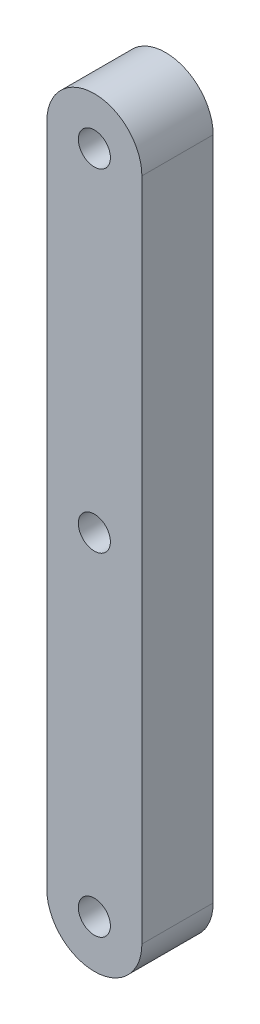
ISO-10303-21;
HEADER;
FILE_DESCRIPTION(('STEP AP214'),'2;1');
FILE_NAME('part.step','',(''),(''),'','','');
FILE_SCHEMA(('AUTOMOTIVE_DESIGN { 1 0 10303 214 1 1 1 1 }'));
ENDSEC;
DATA;
#1=APPLICATION_CONTEXT('core data for automotive mechanical design processes');
#2=APPLICATION_PROTOCOL_DEFINITION('international standard','automotive_design',2000,#1);
#3=PRODUCT_CONTEXT('',#1,'mechanical');
#4=PRODUCT('Part','Part','',(#3));
#5=PRODUCT_RELATED_PRODUCT_CATEGORY('part','',(#4));
#6=PRODUCT_DEFINITION_FORMATION('','',#4);
#7=PRODUCT_DEFINITION_CONTEXT('part definition',#1,'design');
#8=PRODUCT_DEFINITION('design','',#6,#7);
#9=PRODUCT_DEFINITION_SHAPE('','',#8);
#10=(LENGTH_UNIT() NAMED_UNIT(*) SI_UNIT(.MILLI.,.METRE.));
#11=(NAMED_UNIT(*) PLANE_ANGLE_UNIT() SI_UNIT($,.RADIAN.));
#12=(NAMED_UNIT(*) SI_UNIT($,.STERADIAN.) SOLID_ANGLE_UNIT());
#13=UNCERTAINTY_MEASURE_WITH_UNIT(LENGTH_MEASURE(1.E-05),#10,'distance_accuracy_value','');
#14=(GEOMETRIC_REPRESENTATION_CONTEXT(3) GLOBAL_UNCERTAINTY_ASSIGNED_CONTEXT((#13)) GLOBAL_UNIT_ASSIGNED_CONTEXT((#10,
#11,#12)) REPRESENTATION_CONTEXT('',''));
#15=CARTESIAN_POINT('',(0.,0.,0.));
#16=DIRECTION('',(0.,0.,1.));
#17=DIRECTION('',(1.,0.,0.));
#18=AXIS2_PLACEMENT_3D('',#15,#16,#17);
#19=CARTESIAN_POINT('',(5.08,0.,7.62));
#20=DIRECTION('',(0.,0.,-1.));
#21=DIRECTION('',(-1.,0.,0.));
#22=AXIS2_PLACEMENT_3D('',#19,#20,#21);
#23=PLANE('',#22);
#24=CARTESIAN_POINT('',(5.08,35.56,7.62));
#25=DIRECTION('',(0.,0.,1.));
#26=DIRECTION('',(1.,0.,0.));
#27=AXIS2_PLACEMENT_3D('',#24,#25,#26);
#28=CIRCLE('',#27,1.7145);
#29=CARTESIAN_POINT('',(6.79450000000001,35.56,7.62));
#30=VERTEX_POINT('',#29);
#31=EDGE_CURVE('E125',#30,#30,#28,.T.);
#32=ORIENTED_EDGE('',*,*,#31,.F.);
#33=EDGE_LOOP('',(#32));
#34=FACE_BOUND('',#33,.T.);
#35=CARTESIAN_POINT('',(5.08,0.,7.62));
#36=DIRECTION('',(0.,0.,1.));
#37=DIRECTION('',(-1.,0.,0.));
#38=AXIS2_PLACEMENT_3D('',#35,#36,#37);
#39=CIRCLE('',#38,5.08);
#40=CARTESIAN_POINT('',(0.,0.,7.62));
#41=VERTEX_POINT('',#40);
#42=CARTESIAN_POINT('',(10.16,0.,7.62));
#43=VERTEX_POINT('',#42);
#44=EDGE_CURVE('E86',#41,#43,#39,.T.);
#45=ORIENTED_EDGE('',*,*,#44,.T.);
#46=DIRECTION('',(0.,1.,0.));
#47=VECTOR('',#46,1.);
#48=CARTESIAN_POINT('',(10.16,71.12,7.62));
#49=LINE('',#48,#47);
#50=CARTESIAN_POINT('',(10.16,71.12,7.62));
#51=VERTEX_POINT('',#50);
#52=EDGE_CURVE('E81',#43,#51,#49,.T.);
#53=ORIENTED_EDGE('',*,*,#52,.T.);
#54=CARTESIAN_POINT('',(5.08,71.12,7.62));
#55=DIRECTION('',(0.,0.,1.));
#56=DIRECTION('',(-1.,0.,0.));
#57=AXIS2_PLACEMENT_3D('',#54,#55,#56);
#58=CIRCLE('',#57,5.08);
#59=CARTESIAN_POINT('',(0.,71.12,7.62));
#60=VERTEX_POINT('',#59);
#61=EDGE_CURVE('E84',#51,#60,#58,.T.);
#62=ORIENTED_EDGE('',*,*,#61,.T.);
#63=DIRECTION('',(0.,-1.,0.));
#64=VECTOR('',#63,1.);
#65=CARTESIAN_POINT('',(0.,0.,7.62));
#66=LINE('',#65,#64);
#67=EDGE_CURVE('E51',#60,#41,#66,.T.);
#68=ORIENTED_EDGE('',*,*,#67,.T.);
#69=EDGE_LOOP('',(#45,#53,#62,#68));
#70=FACE_BOUND('',#69,.T.);
#71=CARTESIAN_POINT('',(5.08,71.12,7.62));
#72=DIRECTION('',(0.,0.,1.));
#73=DIRECTION('',(1.,0.,0.));
#74=AXIS2_PLACEMENT_3D('',#71,#72,#73);
#75=CIRCLE('',#74,1.7145);
#76=CARTESIAN_POINT('',(6.7945,71.12,7.62));
#77=VERTEX_POINT('',#76);
#78=EDGE_CURVE('E102',#77,#77,#75,.T.);
#79=ORIENTED_EDGE('',*,*,#78,.F.);
#80=EDGE_LOOP('',(#79));
#81=FACE_BOUND('',#80,.T.);
#82=CARTESIAN_POINT('',(5.08,0.,7.62));
#83=DIRECTION('',(0.,0.,1.));
#84=DIRECTION('',(1.,0.,0.));
#85=AXIS2_PLACEMENT_3D('',#82,#83,#84);
#86=CIRCLE('',#85,1.7145);
#87=CARTESIAN_POINT('',(6.7945,0.,7.62));
#88=VERTEX_POINT('',#87);
#89=EDGE_CURVE('E117',#88,#88,#86,.T.);
#90=ORIENTED_EDGE('',*,*,#89,.F.);
#91=EDGE_LOOP('',(#90));
#92=FACE_BOUND('',#91,.T.);
#93=ADVANCED_FACE('F33',(#34,#70,#81,#92),#23,.F.);
#94=CARTESIAN_POINT('',(5.08,0.,0.));
#95=DIRECTION('',(0.,0.,-1.));
#96=DIRECTION('',(-1.,0.,0.));
#97=AXIS2_PLACEMENT_3D('',#94,#95,#96);
#98=PLANE('',#97);
#99=CARTESIAN_POINT('',(5.08,35.56,0.));
#100=DIRECTION('',(0.,0.,-1.));
#101=DIRECTION('',(-1.,0.,0.));
#102=AXIS2_PLACEMENT_3D('',#99,#100,#101);
#103=CIRCLE('',#102,1.7145);
#104=CARTESIAN_POINT('',(3.3655,35.56,0.));
#105=VERTEX_POINT('',#104);
#106=EDGE_CURVE('E37',#105,#105,#103,.T.);
#107=ORIENTED_EDGE('',*,*,#106,.F.);
#108=EDGE_LOOP('',(#107));
#109=FACE_BOUND('',#108,.T.);
#110=CARTESIAN_POINT('',(5.08,71.12,0.));
#111=DIRECTION('',(0.,0.,1.));
#112=DIRECTION('',(1.,0.,0.));
#113=AXIS2_PLACEMENT_3D('',#110,#111,#112);
#114=CIRCLE('',#113,1.7145);
#115=CARTESIAN_POINT('',(6.7945,71.12,0.));
#116=VERTEX_POINT('',#115);
#117=EDGE_CURVE('E114',#116,#116,#114,.T.);
#118=ORIENTED_EDGE('',*,*,#117,.T.);
#119=EDGE_LOOP('',(#118));
#120=FACE_BOUND('',#119,.T.);
#121=CARTESIAN_POINT('',(5.08,0.,0.));
#122=DIRECTION('',(0.,0.,1.));
#123=DIRECTION('',(-1.,0.,0.));
#124=AXIS2_PLACEMENT_3D('',#121,#122,#123);
#125=CIRCLE('',#124,5.08);
#126=CARTESIAN_POINT('',(0.,0.,0.));
#127=VERTEX_POINT('',#126);
#128=CARTESIAN_POINT('',(10.16,0.,0.));
#129=VERTEX_POINT('',#128);
#130=EDGE_CURVE('E99',#127,#129,#125,.T.);
#131=ORIENTED_EDGE('',*,*,#130,.F.);
#132=DIRECTION('',(0.,-1.,0.));
#133=VECTOR('',#132,1.);
#134=CARTESIAN_POINT('',(0.,0.,0.));
#135=LINE('',#134,#133);
#136=CARTESIAN_POINT('',(0.,71.12,0.));
#137=VERTEX_POINT('',#136);
#138=EDGE_CURVE('E74',#137,#127,#135,.T.);
#139=ORIENTED_EDGE('',*,*,#138,.F.);
#140=CARTESIAN_POINT('',(5.08,71.12,0.));
#141=DIRECTION('',(0.,0.,1.));
#142=DIRECTION('',(-1.,0.,0.));
#143=AXIS2_PLACEMENT_3D('',#140,#141,#142);
#144=CIRCLE('',#143,5.08);
#145=CARTESIAN_POINT('',(10.16,71.12,0.));
#146=VERTEX_POINT('',#145);
#147=EDGE_CURVE('E68',#146,#137,#144,.T.);
#148=ORIENTED_EDGE('',*,*,#147,.F.);
#149=DIRECTION('',(0.,1.,0.));
#150=VECTOR('',#149,1.);
#151=CARTESIAN_POINT('',(10.16,71.12,0.));
#152=LINE('',#151,#150);
#153=EDGE_CURVE('E90',#129,#146,#152,.T.);
#154=ORIENTED_EDGE('',*,*,#153,.F.);
#155=EDGE_LOOP('',(#131,#139,#148,#154));
#156=FACE_BOUND('',#155,.T.);
#157=CARTESIAN_POINT('',(5.08,0.,0.));
#158=DIRECTION('',(0.,0.,1.));
#159=DIRECTION('',(1.,0.,0.));
#160=AXIS2_PLACEMENT_3D('',#157,#158,#159);
#161=CIRCLE('',#160,1.7145);
#162=CARTESIAN_POINT('',(6.7945,0.,0.));
#163=VERTEX_POINT('',#162);
#164=EDGE_CURVE('E120',#163,#163,#161,.T.);
#165=ORIENTED_EDGE('',*,*,#164,.T.);
#166=EDGE_LOOP('',(#165));
#167=FACE_BOUND('',#166,.T.);
#168=ADVANCED_FACE('F110',(#109,#120,#156,#167),#98,.T.);
#169=CARTESIAN_POINT('',(5.08,0.,7.62));
#170=DIRECTION('',(0.,0.,-1.));
#171=DIRECTION('',(-1.,0.,0.));
#172=AXIS2_PLACEMENT_3D('',#169,#170,#171);
#173=CYLINDRICAL_SURFACE('',#172,5.08);
#174=ORIENTED_EDGE('',*,*,#130,.T.);
#175=DIRECTION('',(0.,0.,-1.));
#176=VECTOR('',#175,1.);
#177=CARTESIAN_POINT('',(10.16,0.,7.62));
#178=LINE('',#177,#176);
#179=EDGE_CURVE('E11',#43,#129,#178,.T.);
#180=ORIENTED_EDGE('',*,*,#179,.F.);
#181=ORIENTED_EDGE('',*,*,#44,.F.);
#182=DIRECTION('',(0.,0.,-1.));
#183=VECTOR('',#182,1.);
#184=CARTESIAN_POINT('',(0.,0.,7.62));
#185=LINE('',#184,#183);
#186=EDGE_CURVE('E95',#41,#127,#185,.T.);
#187=ORIENTED_EDGE('',*,*,#186,.T.);
#188=EDGE_LOOP('',(#174,#180,#181,#187));
#189=FACE_BOUND('',#188,.T.);
#190=ADVANCED_FACE('F35',(#189),#173,.T.);
#191=CARTESIAN_POINT('',(10.16,71.12,7.62));
#192=DIRECTION('',(-1.,0.,0.));
#193=DIRECTION('',(0.,-1.,0.));
#194=AXIS2_PLACEMENT_3D('',#191,#192,#193);
#195=PLANE('',#194);
#196=ORIENTED_EDGE('',*,*,#153,.T.);
#197=DIRECTION('',(0.,0.,-1.));
#198=VECTOR('',#197,1.);
#199=CARTESIAN_POINT('',(10.16,71.12,7.62));
#200=LINE('',#199,#198);
#201=EDGE_CURVE('E43',#51,#146,#200,.T.);
#202=ORIENTED_EDGE('',*,*,#201,.F.);
#203=ORIENTED_EDGE('',*,*,#52,.F.);
#204=ORIENTED_EDGE('',*,*,#179,.T.);
#205=EDGE_LOOP('',(#196,#202,#203,#204));
#206=FACE_BOUND('',#205,.T.);
#207=ADVANCED_FACE('F89',(#206),#195,.F.);
#208=CARTESIAN_POINT('',(5.08,71.12,7.62));
#209=DIRECTION('',(0.,0.,-1.));
#210=DIRECTION('',(-1.,0.,0.));
#211=AXIS2_PLACEMENT_3D('',#208,#209,#210);
#212=CYLINDRICAL_SURFACE('',#211,5.08);
#213=ORIENTED_EDGE('',*,*,#147,.T.);
#214=DIRECTION('',(0.,0.,-1.));
#215=VECTOR('',#214,1.);
#216=CARTESIAN_POINT('',(0.,71.12,7.62));
#217=LINE('',#216,#215);
#218=EDGE_CURVE('E91',#60,#137,#217,.T.);
#219=ORIENTED_EDGE('',*,*,#218,.F.);
#220=ORIENTED_EDGE('',*,*,#61,.F.);
#221=ORIENTED_EDGE('',*,*,#201,.T.);
#222=EDGE_LOOP('',(#213,#219,#220,#221));
#223=FACE_BOUND('',#222,.T.);
#224=ADVANCED_FACE('F93',(#223),#212,.T.);
#225=CARTESIAN_POINT('',(0.,0.,7.62));
#226=DIRECTION('',(1.,0.,0.));
#227=DIRECTION('',(0.,0.,-1.));
#228=AXIS2_PLACEMENT_3D('',#225,#226,#227);
#229=PLANE('',#228);
#230=ORIENTED_EDGE('',*,*,#138,.T.);
#231=ORIENTED_EDGE('',*,*,#186,.F.);
#232=ORIENTED_EDGE('',*,*,#67,.F.);
#233=ORIENTED_EDGE('',*,*,#218,.T.);
#234=EDGE_LOOP('',(#230,#231,#232,#233));
#235=FACE_BOUND('',#234,.T.);
#236=ADVANCED_FACE('F107',(#235),#229,.F.);
#237=CARTESIAN_POINT('',(5.08,71.12,7.62));
#238=DIRECTION('',(0.,0.,-1.));
#239=DIRECTION('',(-1.,0.,0.));
#240=AXIS2_PLACEMENT_3D('',#237,#238,#239);
#241=CYLINDRICAL_SURFACE('',#240,1.7145);
#242=ORIENTED_EDGE('',*,*,#78,.T.);
#243=EDGE_LOOP('',(#242));
#244=FACE_BOUND('',#243,.T.);
#245=ORIENTED_EDGE('',*,*,#117,.F.);
#246=EDGE_LOOP('',(#245));
#247=FACE_BOUND('',#246,.T.);
#248=ADVANCED_FACE('F139',(#244,#247),#241,.F.);
#249=CARTESIAN_POINT('',(5.08,0.,7.62));
#250=DIRECTION('',(0.,0.,-1.));
#251=DIRECTION('',(-1.,0.,0.));
#252=AXIS2_PLACEMENT_3D('',#249,#250,#251);
#253=CYLINDRICAL_SURFACE('',#252,1.7145);
#254=ORIENTED_EDGE('',*,*,#89,.T.);
#255=EDGE_LOOP('',(#254));
#256=FACE_BOUND('',#255,.T.);
#257=ORIENTED_EDGE('',*,*,#164,.F.);
#258=EDGE_LOOP('',(#257));
#259=FACE_BOUND('',#258,.T.);
#260=ADVANCED_FACE('F141',(#256,#259),#253,.F.);
#261=CARTESIAN_POINT('',(5.08,35.56,-2.54));
#262=DIRECTION('',(0.,0.,1.));
#263=DIRECTION('',(1.,0.,0.));
#264=AXIS2_PLACEMENT_3D('',#261,#262,#263);
#265=CYLINDRICAL_SURFACE('',#264,1.7145);
#266=ORIENTED_EDGE('',*,*,#106,.T.);
#267=EDGE_LOOP('',(#266));
#268=FACE_BOUND('',#267,.T.);
#269=ORIENTED_EDGE('',*,*,#31,.T.);
#270=EDGE_LOOP('',(#269));
#271=FACE_BOUND('',#270,.T.);
#272=ADVANCED_FACE('F132',(#268,#271),#265,.F.);
#273=CLOSED_SHELL('',(#93,#168,#190,#207,#224,#236,#248,#260,#272));
#274=MANIFOLD_SOLID_BREP('B2',#273);
#275=ADVANCED_BREP_SHAPE_REPRESENTATION('',(#18,#274),#14);
#276=SHAPE_DEFINITION_REPRESENTATION(#9,#275);
ENDSEC;
END-ISO-10303-21;
